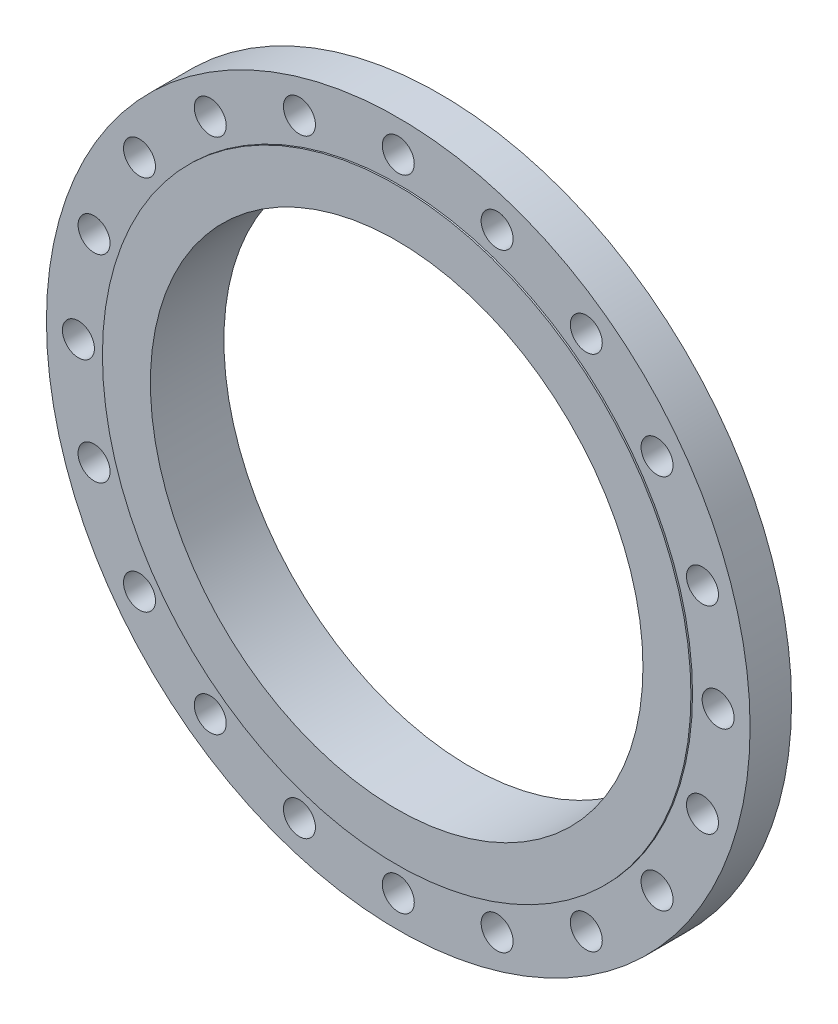
ISO-10303-21;
HEADER;
FILE_DESCRIPTION(('STEP AP214'),'2;1');
FILE_NAME('part.step','',(''),(''),'','','');
FILE_SCHEMA(('AUTOMOTIVE_DESIGN { 1 0 10303 214 1 1 1 1 }'));
ENDSEC;
DATA;
#1=APPLICATION_CONTEXT('core data for automotive mechanical design processes');
#2=APPLICATION_PROTOCOL_DEFINITION('international standard','automotive_design',2000,#1);
#3=PRODUCT_CONTEXT('',#1,'mechanical');
#4=PRODUCT('Part','Part','',(#3));
#5=PRODUCT_RELATED_PRODUCT_CATEGORY('part','',(#4));
#6=PRODUCT_DEFINITION_FORMATION('','',#4);
#7=PRODUCT_DEFINITION_CONTEXT('part definition',#1,'design');
#8=PRODUCT_DEFINITION('design','',#6,#7);
#9=PRODUCT_DEFINITION_SHAPE('','',#8);
#10=(LENGTH_UNIT() NAMED_UNIT(*) SI_UNIT(.MILLI.,.METRE.));
#11=(NAMED_UNIT(*) PLANE_ANGLE_UNIT() SI_UNIT($,.RADIAN.));
#12=(NAMED_UNIT(*) SI_UNIT($,.STERADIAN.) SOLID_ANGLE_UNIT());
#13=UNCERTAINTY_MEASURE_WITH_UNIT(LENGTH_MEASURE(1.E-05),#10,'distance_accuracy_value','');
#14=(GEOMETRIC_REPRESENTATION_CONTEXT(3) GLOBAL_UNCERTAINTY_ASSIGNED_CONTEXT((#13)) GLOBAL_UNIT_ASSIGNED_CONTEXT((#10,
#11,#12)) REPRESENTATION_CONTEXT('',''));
#15=CARTESIAN_POINT('',(0.,0.,0.));
#16=DIRECTION('',(0.,0.,1.));
#17=DIRECTION('',(1.,0.,0.));
#18=AXIS2_PLACEMENT_3D('',#15,#16,#17);
#19=CARTESIAN_POINT('',(0.,0.,31.07405273676));
#20=DIRECTION('',(0.,0.,-1.));
#21=DIRECTION('',(-1.,0.,0.));
#22=AXIS2_PLACEMENT_3D('',#19,#20,#21);
#23=CYLINDRICAL_SURFACE('',#22,292.1);
#24=CARTESIAN_POINT('',(0.,0.,29.48655273676));
#25=DIRECTION('',(0.,0.,1.));
#26=DIRECTION('',(1.,0.,0.));
#27=AXIS2_PLACEMENT_3D('',#24,#25,#26);
#28=CIRCLE('',#27,292.1);
#29=CARTESIAN_POINT('',(292.1,0.,29.48655273676));
#30=VERTEX_POINT('',#29);
#31=EDGE_CURVE('E48',#30,#30,#28,.T.);
#32=ORIENTED_EDGE('',*,*,#31,.T.);
#33=EDGE_LOOP('',(#32));
#34=FACE_BOUND('',#33,.T.);
#35=CARTESIAN_POINT('',(0.,0.,31.07405273676));
#36=DIRECTION('',(0.,0.,1.));
#37=DIRECTION('',(1.,0.,0.));
#38=AXIS2_PLACEMENT_3D('',#35,#36,#37);
#39=CIRCLE('',#38,292.1);
#40=CARTESIAN_POINT('',(292.1,0.,31.07405273676));
#41=VERTEX_POINT('',#40);
#42=EDGE_CURVE('E10',#41,#41,#39,.T.);
#43=ORIENTED_EDGE('',*,*,#42,.F.);
#44=EDGE_LOOP('',(#43));
#45=FACE_BOUND('',#44,.T.);
#46=ADVANCED_FACE('F37',(#34,#45),#23,.T.);
#47=CARTESIAN_POINT('',(0.,0.,31.07405273676));
#48=DIRECTION('',(0.,0.,1.));
#49=DIRECTION('',(1.,0.,0.));
#50=AXIS2_PLACEMENT_3D('',#47,#48,#49);
#51=PLANE('',#50);
#52=CARTESIAN_POINT('',(0.,0.,31.07405273676));
#53=DIRECTION('',(0.,0.,1.));
#54=DIRECTION('',(1.,0.,0.));
#55=AXIS2_PLACEMENT_3D('',#52,#53,#54);
#56=CIRCLE('',#55,244.475);
#57=CARTESIAN_POINT('',(244.475,0.,31.07405273676));
#58=VERTEX_POINT('',#57);
#59=EDGE_CURVE('E44',#58,#58,#56,.F.);
#60=ORIENTED_EDGE('',*,*,#59,.T.);
#61=EDGE_LOOP('',(#60));
#62=FACE_BOUND('',#61,.T.);
#63=ORIENTED_EDGE('',*,*,#42,.T.);
#64=EDGE_LOOP('',(#63));
#65=FACE_BOUND('',#64,.T.);
#66=ADVANCED_FACE('F204',(#62,#65),#51,.T.);
#67=CARTESIAN_POINT('',(0.,0.,81.87405273676));
#68=DIRECTION('',(0.,0.,-1.));
#69=DIRECTION('',(-1.,0.,0.));
#70=AXIS2_PLACEMENT_3D('',#67,#68,#69);
#71=CYLINDRICAL_SURFACE('',#70,244.475);
#72=ORIENTED_EDGE('',*,*,#59,.F.);
#73=EDGE_LOOP('',(#72));
#74=FACE_BOUND('',#73,.T.);
#75=CARTESIAN_POINT('',(0.,0.,-41.88744726324));
#76=DIRECTION('',(0.,0.,1.));
#77=DIRECTION('',(1.,0.,0.));
#78=AXIS2_PLACEMENT_3D('',#75,#76,#77);
#79=CIRCLE('',#78,244.475);
#80=CARTESIAN_POINT('',(244.475,0.,-41.88744726324));
#81=VERTEX_POINT('',#80);
#82=EDGE_CURVE('E40',#81,#81,#79,.T.);
#83=ORIENTED_EDGE('',*,*,#82,.F.);
#84=EDGE_LOOP('',(#83));
#85=FACE_BOUND('',#84,.T.);
#86=ADVANCED_FACE('F209',(#74,#85),#71,.F.);
#87=CARTESIAN_POINT('',(0.,0.,29.48655273676));
#88=DIRECTION('',(0.,0.,-1.));
#89=DIRECTION('',(-1.,0.,0.));
#90=AXIS2_PLACEMENT_3D('',#87,#88,#89);
#91=CYLINDRICAL_SURFACE('',#90,349.25);
#92=CARTESIAN_POINT('',(0.,0.,29.48655273676));
#93=DIRECTION('',(0.,0.,1.));
#94=DIRECTION('',(1.,0.,0.));
#95=AXIS2_PLACEMENT_3D('',#92,#93,#94);
#96=CIRCLE('',#95,349.25);
#97=CARTESIAN_POINT('',(349.25,0.,29.48655273676));
#98=VERTEX_POINT('',#97);
#99=EDGE_CURVE('E53',#98,#98,#96,.T.);
#100=ORIENTED_EDGE('',*,*,#99,.F.);
#101=EDGE_LOOP('',(#100));
#102=FACE_BOUND('',#101,.T.);
#103=CARTESIAN_POINT('',(0.,0.,-11.66144726324));
#104=DIRECTION('',(0.,0.,1.));
#105=DIRECTION('',(1.,0.,0.));
#106=AXIS2_PLACEMENT_3D('',#103,#104,#105);
#107=CIRCLE('',#106,349.25);
#108=CARTESIAN_POINT('',(349.25,0.,-11.66144726324));
#109=VERTEX_POINT('',#108);
#110=EDGE_CURVE('E54',#109,#109,#107,.T.);
#111=ORIENTED_EDGE('',*,*,#110,.T.);
#112=EDGE_LOOP('',(#111));
#113=FACE_BOUND('',#112,.T.);
#114=ADVANCED_FACE('F219',(#102,#113),#91,.T.);
#115=CARTESIAN_POINT('',(0.,0.,29.48655273676));
#116=DIRECTION('',(0.,0.,1.));
#117=DIRECTION('',(1.,0.,0.));
#118=AXIS2_PLACEMENT_3D('',#115,#116,#117);
#119=PLANE('',#118);
#120=CARTESIAN_POINT('',(186.621817602861,256.862895714046,29.4865527367601));
#121=DIRECTION('',(0.,0.,1.));
#122=DIRECTION('',(1.,0.,0.));
#123=AXIS2_PLACEMENT_3D('',#120,#121,#122);
#124=CIRCLE('',#123,15.875);
#125=CARTESIAN_POINT('',(202.496817602861,256.862895714046,29.4865527367601));
#126=VERTEX_POINT('',#125);
#127=EDGE_CURVE('E65',#126,#126,#124,.F.);
#128=ORIENTED_EDGE('',*,*,#127,.T.);
#129=EDGE_LOOP('',(#128));
#130=FACE_BOUND('',#129,.T.);
#131=CARTESIAN_POINT('',(256.862895714046,186.62181760286,29.4865527367601));
#132=DIRECTION('',(0.,0.,1.));
#133=DIRECTION('',(1.,0.,0.));
#134=AXIS2_PLACEMENT_3D('',#131,#132,#133);
#135=CIRCLE('',#134,15.875);
#136=CARTESIAN_POINT('',(272.737895714046,186.62181760286,29.4865527367601));
#137=VERTEX_POINT('',#136);
#138=EDGE_CURVE('E68',#137,#137,#135,.F.);
#139=ORIENTED_EDGE('',*,*,#138,.T.);
#140=EDGE_LOOP('',(#139));
#141=FACE_BOUND('',#140,.T.);
#142=CARTESIAN_POINT('',(301.960443923712,98.112895714045,29.4865527367601));
#143=DIRECTION('',(0.,0.,1.));
#144=DIRECTION('',(1.,0.,0.));
#145=AXIS2_PLACEMENT_3D('',#142,#143,#144);
#146=CIRCLE('',#145,15.875);
#147=CARTESIAN_POINT('',(317.835443923712,98.112895714045,29.4865527367601));
#148=VERTEX_POINT('',#147);
#149=EDGE_CURVE('E71',#148,#148,#146,.F.);
#150=ORIENTED_EDGE('',*,*,#149,.T.);
#151=EDGE_LOOP('',(#150));
#152=FACE_BOUND('',#151,.T.);
#153=CARTESIAN_POINT('',(317.5,-1.06346186208606E-12,29.4865527367601));
#154=DIRECTION('',(0.,0.,1.));
#155=DIRECTION('',(1.,0.,0.));
#156=AXIS2_PLACEMENT_3D('',#153,#154,#155);
#157=CIRCLE('',#156,15.875);
#158=CARTESIAN_POINT('',(333.375,-1.06346186208606E-12,29.4865527367601));
#159=VERTEX_POINT('',#158);
#160=EDGE_CURVE('E74',#159,#159,#157,.F.);
#161=ORIENTED_EDGE('',*,*,#160,.T.);
#162=EDGE_LOOP('',(#161));
#163=FACE_BOUND('',#162,.T.);
#164=CARTESIAN_POINT('',(301.960443923711,-98.1128957140471,29.4865527367601));
#165=DIRECTION('',(0.,0.,1.));
#166=DIRECTION('',(1.,0.,0.));
#167=AXIS2_PLACEMENT_3D('',#164,#165,#166);
#168=CIRCLE('',#167,15.875);
#169=CARTESIAN_POINT('',(317.835443923711,-98.1128957140471,29.4865527367601));
#170=VERTEX_POINT('',#169);
#171=EDGE_CURVE('E77',#170,#170,#168,.F.);
#172=ORIENTED_EDGE('',*,*,#171,.T.);
#173=EDGE_LOOP('',(#172));
#174=FACE_BOUND('',#173,.T.);
#175=CARTESIAN_POINT('',(256.862895714045,-186.621817602861,29.4865527367601));
#176=DIRECTION('',(0.,0.,1.));
#177=DIRECTION('',(1.,0.,0.));
#178=AXIS2_PLACEMENT_3D('',#175,#176,#177);
#179=CIRCLE('',#178,15.875);
#180=CARTESIAN_POINT('',(272.737895714045,-186.621817602861,29.4865527367601));
#181=VERTEX_POINT('',#180);
#182=EDGE_CURVE('E80',#181,#181,#179,.F.);
#183=ORIENTED_EDGE('',*,*,#182,.T.);
#184=EDGE_LOOP('',(#183));
#185=FACE_BOUND('',#184,.T.);
#186=CARTESIAN_POINT('',(186.621817602859,-256.862895714047,29.4865527367601));
#187=DIRECTION('',(0.,0.,1.));
#188=DIRECTION('',(1.,0.,0.));
#189=AXIS2_PLACEMENT_3D('',#186,#187,#188);
#190=CIRCLE('',#189,15.875);
#191=CARTESIAN_POINT('',(202.496817602859,-256.862895714047,29.4865527367601));
#192=VERTEX_POINT('',#191);
#193=EDGE_CURVE('E83',#192,#192,#190,.F.);
#194=ORIENTED_EDGE('',*,*,#193,.T.);
#195=EDGE_LOOP('',(#194));
#196=FACE_BOUND('',#195,.T.);
#197=CARTESIAN_POINT('',(98.1128957140438,-301.960443923712,29.4865527367601));
#198=DIRECTION('',(0.,0.,1.));
#199=DIRECTION('',(1.,0.,0.));
#200=AXIS2_PLACEMENT_3D('',#197,#198,#199);
#201=CIRCLE('',#200,15.875);
#202=CARTESIAN_POINT('',(113.987895714044,-301.960443923712,29.4865527367601));
#203=VERTEX_POINT('',#202);
#204=EDGE_CURVE('E86',#203,#203,#201,.F.);
#205=ORIENTED_EDGE('',*,*,#204,.T.);
#206=EDGE_LOOP('',(#205));
#207=FACE_BOUND('',#206,.T.);
#208=CARTESIAN_POINT('',(0.,-317.5,29.4865527367601));
#209=DIRECTION('',(0.,0.,1.));
#210=DIRECTION('',(1.,0.,0.));
#211=AXIS2_PLACEMENT_3D('',#208,#209,#210);
#212=CIRCLE('',#211,15.875);
#213=CARTESIAN_POINT('',(15.875,-317.5,29.4865527367601));
#214=VERTEX_POINT('',#213);
#215=EDGE_CURVE('E89',#214,#214,#212,.F.);
#216=ORIENTED_EDGE('',*,*,#215,.T.);
#217=EDGE_LOOP('',(#216));
#218=FACE_BOUND('',#217,.T.);
#219=CARTESIAN_POINT('',(-98.1128957140482,-301.96044392371,29.4865527367601));
#220=DIRECTION('',(0.,0.,1.));
#221=DIRECTION('',(1.,0.,0.));
#222=AXIS2_PLACEMENT_3D('',#219,#220,#221);
#223=CIRCLE('',#222,15.875);
#224=CARTESIAN_POINT('',(-82.2378957140482,-301.96044392371,29.4865527367601));
#225=VERTEX_POINT('',#224);
#226=EDGE_CURVE('E92',#225,#225,#223,.F.);
#227=ORIENTED_EDGE('',*,*,#226,.T.);
#228=EDGE_LOOP('',(#227));
#229=FACE_BOUND('',#228,.T.);
#230=CARTESIAN_POINT('',(-186.621817602862,-256.862895714044,29.4865527367601));
#231=DIRECTION('',(0.,0.,1.));
#232=DIRECTION('',(1.,0.,0.));
#233=AXIS2_PLACEMENT_3D('',#230,#231,#232);
#234=CIRCLE('',#233,15.875);
#235=CARTESIAN_POINT('',(-170.746817602862,-256.862895714044,29.4865527367601));
#236=VERTEX_POINT('',#235);
#237=EDGE_CURVE('E95',#236,#236,#234,.F.);
#238=ORIENTED_EDGE('',*,*,#237,.T.);
#239=EDGE_LOOP('',(#238));
#240=FACE_BOUND('',#239,.T.);
#241=CARTESIAN_POINT('',(-256.862895714048,-186.621817602858,29.4865527367601));
#242=DIRECTION('',(0.,0.,1.));
#243=DIRECTION('',(1.,0.,0.));
#244=AXIS2_PLACEMENT_3D('',#241,#242,#243);
#245=CIRCLE('',#244,15.875);
#246=CARTESIAN_POINT('',(-240.987895714048,-186.621817602858,29.4865527367601));
#247=VERTEX_POINT('',#246);
#248=EDGE_CURVE('E98',#247,#247,#245,.F.);
#249=ORIENTED_EDGE('',*,*,#248,.T.);
#250=EDGE_LOOP('',(#249));
#251=FACE_BOUND('',#250,.T.);
#252=CARTESIAN_POINT('',(-301.960443923712,-98.1128957140429,29.4865527367601));
#253=DIRECTION('',(0.,0.,1.));
#254=DIRECTION('',(1.,0.,0.));
#255=AXIS2_PLACEMENT_3D('',#252,#253,#254);
#256=CIRCLE('',#255,15.875);
#257=CARTESIAN_POINT('',(-286.085443923712,-98.1128957140429,29.4865527367601));
#258=VERTEX_POINT('',#257);
#259=EDGE_CURVE('E101',#258,#258,#256,.F.);
#260=ORIENTED_EDGE('',*,*,#259,.T.);
#261=EDGE_LOOP('',(#260));
#262=FACE_BOUND('',#261,.T.);
#263=CARTESIAN_POINT('',(-317.5,3.37071943824472E-12,29.4865527367601));
#264=DIRECTION('',(0.,0.,1.));
#265=DIRECTION('',(1.,0.,0.));
#266=AXIS2_PLACEMENT_3D('',#263,#264,#265);
#267=CIRCLE('',#266,15.875);
#268=CARTESIAN_POINT('',(-301.625,3.37071943824472E-12,29.4865527367601));
#269=VERTEX_POINT('',#268);
#270=EDGE_CURVE('E104',#269,#269,#267,.F.);
#271=ORIENTED_EDGE('',*,*,#270,.T.);
#272=EDGE_LOOP('',(#271));
#273=FACE_BOUND('',#272,.T.);
#274=CARTESIAN_POINT('',(-301.96044392371,98.1128957140493,29.4865527367601));
#275=DIRECTION('',(0.,0.,1.));
#276=DIRECTION('',(1.,0.,0.));
#277=AXIS2_PLACEMENT_3D('',#274,#275,#276);
#278=CIRCLE('',#277,15.875);
#279=CARTESIAN_POINT('',(-286.08544392371,98.1128957140493,29.4865527367601));
#280=VERTEX_POINT('',#279);
#281=EDGE_CURVE('E107',#280,#280,#278,.F.);
#282=ORIENTED_EDGE('',*,*,#281,.T.);
#283=EDGE_LOOP('',(#282));
#284=FACE_BOUND('',#283,.T.);
#285=CARTESIAN_POINT('',(-256.862895714044,186.621817602863,29.4865527367601));
#286=DIRECTION('',(0.,0.,1.));
#287=DIRECTION('',(1.,0.,0.));
#288=AXIS2_PLACEMENT_3D('',#285,#286,#287);
#289=CIRCLE('',#288,15.875);
#290=CARTESIAN_POINT('',(-240.987895714044,186.621817602863,29.4865527367601));
#291=VERTEX_POINT('',#290);
#292=EDGE_CURVE('E110',#291,#291,#289,.F.);
#293=ORIENTED_EDGE('',*,*,#292,.T.);
#294=EDGE_LOOP('',(#293));
#295=FACE_BOUND('',#294,.T.);
#296=CARTESIAN_POINT('',(-186.621817602857,256.862895714048,29.4865527367601));
#297=DIRECTION('',(0.,0.,1.));
#298=DIRECTION('',(1.,0.,0.));
#299=AXIS2_PLACEMENT_3D('',#296,#297,#298);
#300=CIRCLE('',#299,15.875);
#301=CARTESIAN_POINT('',(-170.746817602857,256.862895714048,29.4865527367601));
#302=VERTEX_POINT('',#301);
#303=EDGE_CURVE('E113',#302,#302,#300,.F.);
#304=ORIENTED_EDGE('',*,*,#303,.T.);
#305=EDGE_LOOP('',(#304));
#306=FACE_BOUND('',#305,.T.);
#307=CARTESIAN_POINT('',(-98.1128957140418,301.960443923713,29.4865527367601));
#308=DIRECTION('',(0.,0.,1.));
#309=DIRECTION('',(1.,0.,0.));
#310=AXIS2_PLACEMENT_3D('',#307,#308,#309);
#311=CIRCLE('',#310,15.875);
#312=CARTESIAN_POINT('',(-82.2378957140418,301.960443923713,29.4865527367601));
#313=VERTEX_POINT('',#312);
#314=EDGE_CURVE('E116',#313,#313,#311,.F.);
#315=ORIENTED_EDGE('',*,*,#314,.T.);
#316=EDGE_LOOP('',(#315));
#317=FACE_BOUND('',#316,.T.);
#318=CARTESIAN_POINT('',(98.1128957140461,301.960443923711,29.4865527367601));
#319=DIRECTION('',(0.,0.,1.));
#320=DIRECTION('',(1.,0.,0.));
#321=AXIS2_PLACEMENT_3D('',#318,#319,#320);
#322=CIRCLE('',#321,15.875);
#323=CARTESIAN_POINT('',(113.987895714046,301.960443923711,29.4865527367601));
#324=VERTEX_POINT('',#323);
#325=EDGE_CURVE('E119',#324,#324,#322,.F.);
#326=ORIENTED_EDGE('',*,*,#325,.T.);
#327=EDGE_LOOP('',(#326));
#328=FACE_BOUND('',#327,.T.);
#329=CARTESIAN_POINT('',(0.,317.5,29.4865527367601));
#330=DIRECTION('',(0.,0.,1.));
#331=DIRECTION('',(1.,0.,0.));
#332=AXIS2_PLACEMENT_3D('',#329,#330,#331);
#333=CIRCLE('',#332,15.875);
#334=CARTESIAN_POINT('',(15.875,317.5,29.4865527367601));
#335=VERTEX_POINT('',#334);
#336=EDGE_CURVE('E57',#335,#335,#333,.F.);
#337=ORIENTED_EDGE('',*,*,#336,.T.);
#338=EDGE_LOOP('',(#337));
#339=FACE_BOUND('',#338,.T.);
#340=ORIENTED_EDGE('',*,*,#31,.F.);
#341=EDGE_LOOP('',(#340));
#342=FACE_BOUND('',#341,.T.);
#343=ORIENTED_EDGE('',*,*,#99,.T.);
#344=EDGE_LOOP('',(#343));
#345=FACE_BOUND('',#344,.T.);
#346=ADVANCED_FACE('F215',(#130,#141,#152,#163,#174,#185,#196,#207,#218,#229,#240,#251,#262,
#273,#284,#295,#306,#317,#328,#339,#342,#345),#119,.T.);
#347=CARTESIAN_POINT('',(0.,0.,-11.66144726324));
#348=DIRECTION('',(0.,0.,1.));
#349=DIRECTION('',(1.,0.,0.));
#350=AXIS2_PLACEMENT_3D('',#347,#348,#349);
#351=PLANE('',#350);
#352=CARTESIAN_POINT('',(0.,0.,-11.66144726324));
#353=DIRECTION('',(0.,0.,1.));
#354=DIRECTION('',(1.,0.,0.));
#355=AXIS2_PLACEMENT_3D('',#352,#353,#354);
#356=CIRCLE('',#355,292.1);
#357=CARTESIAN_POINT('',(292.1,0.,-11.66144726324));
#358=VERTEX_POINT('',#357);
#359=EDGE_CURVE('E180',#358,#358,#356,.T.);
#360=ORIENTED_EDGE('',*,*,#359,.T.);
#361=EDGE_LOOP('',(#360));
#362=FACE_BOUND('',#361,.T.);
#363=CARTESIAN_POINT('',(186.621817602861,256.862895714046,-11.66144726324));
#364=DIRECTION('',(0.,0.,1.));
#365=DIRECTION('',(0.809016994374947,-0.587785252292474,0.));
#366=AXIS2_PLACEMENT_3D('',#363,#364,#365);
#367=CIRCLE('',#366,15.875);
#368=CARTESIAN_POINT('',(199.464962388563,247.531804833903,-11.66144726324));
#369=VERTEX_POINT('',#368);
#370=EDGE_CURVE('E125',#369,#369,#367,.T.);
#371=ORIENTED_EDGE('',*,*,#370,.T.);
#372=EDGE_LOOP('',(#371));
#373=FACE_BOUND('',#372,.T.);
#374=CARTESIAN_POINT('',(256.862895714046,186.62181760286,-11.66144726324));
#375=DIRECTION('',(0.,0.,1.));
#376=DIRECTION('',(0.587785252292471,-0.809016994374949,0.));
#377=AXIS2_PLACEMENT_3D('',#374,#375,#376);
#378=CIRCLE('',#377,15.875);
#379=CARTESIAN_POINT('',(266.193986594189,173.778672817157,-11.66144726324));
#380=VERTEX_POINT('',#379);
#381=EDGE_CURVE('E169',#380,#380,#378,.T.);
#382=ORIENTED_EDGE('',*,*,#381,.T.);
#383=EDGE_LOOP('',(#382));
#384=FACE_BOUND('',#383,.T.);
#385=CARTESIAN_POINT('',(301.960443923712,98.112895714045,-11.66144726324));
#386=DIRECTION('',(0.,0.,1.));
#387=DIRECTION('',(0.309016994374945,-0.951056516295155,0.));
#388=AXIS2_PLACEMENT_3D('',#385,#386,#387);
#389=CIRCLE('',#388,15.875);
#390=CARTESIAN_POINT('',(306.866088709414,83.0148735178594,-11.66144726324));
#391=VERTEX_POINT('',#390);
#392=EDGE_CURVE('E166',#391,#391,#389,.T.);
#393=ORIENTED_EDGE('',*,*,#392,.T.);
#394=EDGE_LOOP('',(#393));
#395=FACE_BOUND('',#394,.T.);
#396=CARTESIAN_POINT('',(317.5,-1.06346186208606E-12,-11.66144726324));
#397=DIRECTION('',(0.,0.,1.));
#398=DIRECTION('',(0.,-1.,0.));
#399=AXIS2_PLACEMENT_3D('',#396,#397,#398);
#400=CIRCLE('',#399,15.875);
#401=CARTESIAN_POINT('',(317.5,-15.8750000000011,-11.66144726324));
#402=VERTEX_POINT('',#401);
#403=EDGE_CURVE('E163',#402,#402,#400,.T.);
#404=ORIENTED_EDGE('',*,*,#403,.T.);
#405=EDGE_LOOP('',(#404));
#406=FACE_BOUND('',#405,.T.);
#407=CARTESIAN_POINT('',(301.960443923711,-98.1128957140471,-11.66144726324));
#408=DIRECTION('',(0.,0.,1.));
#409=DIRECTION('',(-0.309016994374952,-0.951056516295152,0.));
#410=AXIS2_PLACEMENT_3D('',#407,#408,#409);
#411=CIRCLE('',#410,15.875);
#412=CARTESIAN_POINT('',(297.054799138009,-113.210917910233,-11.66144726324));
#413=VERTEX_POINT('',#412);
#414=EDGE_CURVE('E160',#413,#413,#411,.T.);
#415=ORIENTED_EDGE('',*,*,#414,.T.);
#416=EDGE_LOOP('',(#415));
#417=FACE_BOUND('',#416,.T.);
#418=CARTESIAN_POINT('',(256.862895714045,-186.621817602861,-11.66144726324));
#419=DIRECTION('',(0.,0.,1.));
#420=DIRECTION('',(-0.587785252292477,-0.809016994374945,0.));
#421=AXIS2_PLACEMENT_3D('',#418,#419,#420);
#422=CIRCLE('',#421,15.875);
#423=CARTESIAN_POINT('',(247.531804833902,-199.464962388564,-11.66144726324));
#424=VERTEX_POINT('',#423);
#425=EDGE_CURVE('E157',#424,#424,#422,.T.);
#426=ORIENTED_EDGE('',*,*,#425,.T.);
#427=EDGE_LOOP('',(#426));
#428=FACE_BOUND('',#427,.T.);
#429=CARTESIAN_POINT('',(186.621817602859,-256.862895714047,-11.66144726324));
#430=DIRECTION('',(0.,0.,1.));
#431=DIRECTION('',(-0.809016994374951,-0.587785252292469,0.));
#432=AXIS2_PLACEMENT_3D('',#429,#430,#431);
#433=CIRCLE('',#432,15.875);
#434=CARTESIAN_POINT('',(173.778672817156,-266.19398659419,-11.66144726324));
#435=VERTEX_POINT('',#434);
#436=EDGE_CURVE('E154',#435,#435,#433,.T.);
#437=ORIENTED_EDGE('',*,*,#436,.T.);
#438=EDGE_LOOP('',(#437));
#439=FACE_BOUND('',#438,.T.);
#440=CARTESIAN_POINT('',(98.1128957140438,-301.960443923712,-11.66144726324));
#441=DIRECTION('',(0.,0.,1.));
#442=DIRECTION('',(-0.951056516295156,-0.309016994374941,0.));
#443=AXIS2_PLACEMENT_3D('',#440,#441,#442);
#444=CIRCLE('',#443,15.875);
#445=CARTESIAN_POINT('',(83.0148735178582,-306.866088709414,-11.66144726324));
#446=VERTEX_POINT('',#445);
#447=EDGE_CURVE('E151',#446,#446,#444,.T.);
#448=ORIENTED_EDGE('',*,*,#447,.T.);
#449=EDGE_LOOP('',(#448));
#450=FACE_BOUND('',#449,.T.);
#451=CARTESIAN_POINT('',(0.,-317.5,-11.66144726324));
#452=DIRECTION('',(0.,0.,1.));
#453=DIRECTION('',(-1.,0.,0.));
#454=AXIS2_PLACEMENT_3D('',#451,#452,#453);
#455=CIRCLE('',#454,15.875);
#456=CARTESIAN_POINT('',(-15.875,-317.5,-11.66144726324));
#457=VERTEX_POINT('',#456);
#458=EDGE_CURVE('E148',#457,#457,#455,.T.);
#459=ORIENTED_EDGE('',*,*,#458,.T.);
#460=EDGE_LOOP('',(#459));
#461=FACE_BOUND('',#460,.T.);
#462=CARTESIAN_POINT('',(-98.1128957140482,-301.96044392371,-11.66144726324));
#463=DIRECTION('',(0.,0.,1.));
#464=DIRECTION('',(-0.951056516295151,0.309016994374955,0.));
#465=AXIS2_PLACEMENT_3D('',#462,#463,#464);
#466=CIRCLE('',#465,15.875);
#467=CARTESIAN_POINT('',(-113.210917910234,-297.054799138008,-11.66144726324));
#468=VERTEX_POINT('',#467);
#469=EDGE_CURVE('E145',#468,#468,#466,.T.);
#470=ORIENTED_EDGE('',*,*,#469,.T.);
#471=EDGE_LOOP('',(#470));
#472=FACE_BOUND('',#471,.T.);
#473=CARTESIAN_POINT('',(-186.621817602862,-256.862895714044,-11.66144726324));
#474=DIRECTION('',(0.,0.,1.));
#475=DIRECTION('',(-0.809016994374942,0.58778525229248,0.));
#476=AXIS2_PLACEMENT_3D('',#473,#474,#475);
#477=CIRCLE('',#476,15.875);
#478=CARTESIAN_POINT('',(-199.464962388565,-247.531804833901,-11.66144726324));
#479=VERTEX_POINT('',#478);
#480=EDGE_CURVE('E142',#479,#479,#477,.T.);
#481=ORIENTED_EDGE('',*,*,#480,.T.);
#482=EDGE_LOOP('',(#481));
#483=FACE_BOUND('',#482,.T.);
#484=CARTESIAN_POINT('',(-256.862895714048,-186.621817602858,-11.66144726324));
#485=DIRECTION('',(0.,0.,1.));
#486=DIRECTION('',(-0.587785252292465,0.809016994374953,0.));
#487=AXIS2_PLACEMENT_3D('',#484,#485,#486);
#488=CIRCLE('',#487,15.875);
#489=CARTESIAN_POINT('',(-266.19398659419,-173.778672817155,-11.66144726324));
#490=VERTEX_POINT('',#489);
#491=EDGE_CURVE('E139',#490,#490,#488,.T.);
#492=ORIENTED_EDGE('',*,*,#491,.T.);
#493=EDGE_LOOP('',(#492));
#494=FACE_BOUND('',#493,.T.);
#495=CARTESIAN_POINT('',(-301.960443923712,-98.1128957140429,-11.66144726324));
#496=DIRECTION('',(0.,0.,1.));
#497=DIRECTION('',(-0.309016994374938,0.951056516295157,0.));
#498=AXIS2_PLACEMENT_3D('',#495,#496,#497);
#499=CIRCLE('',#498,15.875);
#500=CARTESIAN_POINT('',(-306.866088709414,-83.0148735178572,-11.66144726324));
#501=VERTEX_POINT('',#500);
#502=EDGE_CURVE('E136',#501,#501,#499,.T.);
#503=ORIENTED_EDGE('',*,*,#502,.T.);
#504=EDGE_LOOP('',(#503));
#505=FACE_BOUND('',#504,.T.);
#506=CARTESIAN_POINT('',(-317.5,3.37071943824472E-12,-11.66144726324));
#507=DIRECTION('',(0.,0.,1.));
#508=DIRECTION('',(0.,1.,0.));
#509=AXIS2_PLACEMENT_3D('',#506,#507,#508);
#510=CIRCLE('',#509,15.875);
#511=CARTESIAN_POINT('',(-317.5,15.8750000000034,-11.66144726324));
#512=VERTEX_POINT('',#511);
#513=EDGE_CURVE('E133',#512,#512,#510,.T.);
#514=ORIENTED_EDGE('',*,*,#513,.T.);
#515=EDGE_LOOP('',(#514));
#516=FACE_BOUND('',#515,.T.);
#517=CARTESIAN_POINT('',(-301.96044392371,98.1128957140493,-11.66144726324));
#518=DIRECTION('',(0.,0.,1.));
#519=DIRECTION('',(0.309016994374958,0.95105651629515,0.));
#520=AXIS2_PLACEMENT_3D('',#517,#518,#519);
#521=CIRCLE('',#520,15.875);
#522=CARTESIAN_POINT('',(-297.054799138008,113.210917910235,-11.66144726324));
#523=VERTEX_POINT('',#522);
#524=EDGE_CURVE('E129',#523,#523,#521,.T.);
#525=ORIENTED_EDGE('',*,*,#524,.T.);
#526=EDGE_LOOP('',(#525));
#527=FACE_BOUND('',#526,.T.);
#528=CARTESIAN_POINT('',(-256.862895714044,186.621817602863,-11.66144726324));
#529=DIRECTION('',(0.,0.,1.));
#530=DIRECTION('',(0.587785252292483,0.80901699437494,0.));
#531=AXIS2_PLACEMENT_3D('',#528,#529,#530);
#532=CIRCLE('',#531,15.875);
#533=CARTESIAN_POINT('',(-247.5318048339,199.464962388566,-11.66144726324));
#534=VERTEX_POINT('',#533);
#535=EDGE_CURVE('E126',#534,#534,#532,.T.);
#536=ORIENTED_EDGE('',*,*,#535,.T.);
#537=EDGE_LOOP('',(#536));
#538=FACE_BOUND('',#537,.T.);
#539=CARTESIAN_POINT('',(-186.621817602857,256.862895714048,-11.66144726324));
#540=DIRECTION('',(0.,0.,1.));
#541=DIRECTION('',(0.809016994374955,0.587785252292462,0.));
#542=AXIS2_PLACEMENT_3D('',#539,#540,#541);
#543=CIRCLE('',#542,15.875);
#544=CARTESIAN_POINT('',(-173.778672817154,266.193986594191,-11.66144726324));
#545=VERTEX_POINT('',#544);
#546=EDGE_CURVE('E130',#545,#545,#543,.T.);
#547=ORIENTED_EDGE('',*,*,#546,.T.);
#548=EDGE_LOOP('',(#547));
#549=FACE_BOUND('',#548,.T.);
#550=CARTESIAN_POINT('',(-98.1128957140418,301.960443923713,-11.66144726324));
#551=DIRECTION('',(0.,0.,1.));
#552=DIRECTION('',(0.951056516295158,0.309016994374935,0.));
#553=AXIS2_PLACEMENT_3D('',#550,#551,#552);
#554=CIRCLE('',#553,15.875);
#555=CARTESIAN_POINT('',(-83.0148735178562,306.866088709415,-11.66144726324));
#556=VERTEX_POINT('',#555);
#557=EDGE_CURVE('E174',#556,#556,#554,.T.);
#558=ORIENTED_EDGE('',*,*,#557,.T.);
#559=EDGE_LOOP('',(#558));
#560=FACE_BOUND('',#559,.T.);
#561=CARTESIAN_POINT('',(98.1128957140461,301.960443923711,-11.66144726324));
#562=DIRECTION('',(0.,0.,1.));
#563=DIRECTION('',(0.951056516295154,-0.309016994374948,0.));
#564=AXIS2_PLACEMENT_3D('',#561,#562,#563);
#565=CIRCLE('',#564,15.875);
#566=CARTESIAN_POINT('',(113.210917910232,297.054799138009,-11.66144726324));
#567=VERTEX_POINT('',#566);
#568=EDGE_CURVE('E122',#567,#567,#565,.T.);
#569=ORIENTED_EDGE('',*,*,#568,.T.);
#570=EDGE_LOOP('',(#569));
#571=FACE_BOUND('',#570,.T.);
#572=CARTESIAN_POINT('',(0.,317.5,-11.66144726324));
#573=DIRECTION('',(0.,0.,1.));
#574=DIRECTION('',(1.,0.,0.));
#575=AXIS2_PLACEMENT_3D('',#572,#573,#574);
#576=CIRCLE('',#575,15.875);
#577=CARTESIAN_POINT('',(15.875,317.5,-11.66144726324));
#578=VERTEX_POINT('',#577);
#579=EDGE_CURVE('E62',#578,#578,#576,.T.);
#580=ORIENTED_EDGE('',*,*,#579,.T.);
#581=EDGE_LOOP('',(#580));
#582=FACE_BOUND('',#581,.T.);
#583=ORIENTED_EDGE('',*,*,#110,.F.);
#584=EDGE_LOOP('',(#583));
#585=FACE_BOUND('',#584,.T.);
#586=ADVANCED_FACE('F218',(#362,#373,#384,#395,#406,#417,#428,#439,#450,#461,#472,#483,#494,
#505,#516,#527,#538,#549,#560,#571,#582,#585),#351,.F.);
#587=CARTESIAN_POINT('',(0.,317.5,1477.28655273676));
#588=DIRECTION('',(0.,0.,-1.));
#589=DIRECTION('',(-1.,0.,0.));
#590=AXIS2_PLACEMENT_3D('',#587,#588,#589);
#591=CYLINDRICAL_SURFACE('',#590,15.875);
#592=ORIENTED_EDGE('',*,*,#336,.F.);
#593=EDGE_LOOP('',(#592));
#594=FACE_BOUND('',#593,.T.);
#595=ORIENTED_EDGE('',*,*,#579,.F.);
#596=EDGE_LOOP('',(#595));
#597=FACE_BOUND('',#596,.T.);
#598=ADVANCED_FACE('F230',(#594,#597),#591,.F.);
#599=CARTESIAN_POINT('',(98.1128957140461,301.960443923711,1477.28655273676));
#600=DIRECTION('',(0.,0.,-1.));
#601=DIRECTION('',(-1.,0.,0.));
#602=AXIS2_PLACEMENT_3D('',#599,#600,#601);
#603=CYLINDRICAL_SURFACE('',#602,15.875);
#604=ORIENTED_EDGE('',*,*,#325,.F.);
#605=EDGE_LOOP('',(#604));
#606=FACE_BOUND('',#605,.T.);
#607=ORIENTED_EDGE('',*,*,#568,.F.);
#608=EDGE_LOOP('',(#607));
#609=FACE_BOUND('',#608,.T.);
#610=ADVANCED_FACE('F235',(#606,#609),#603,.F.);
#611=CARTESIAN_POINT('',(-98.1128957140418,301.960443923713,1477.28655273676));
#612=DIRECTION('',(0.,0.,-1.));
#613=DIRECTION('',(-1.,0.,0.));
#614=AXIS2_PLACEMENT_3D('',#611,#612,#613);
#615=CYLINDRICAL_SURFACE('',#614,15.875);
#616=ORIENTED_EDGE('',*,*,#314,.F.);
#617=EDGE_LOOP('',(#616));
#618=FACE_BOUND('',#617,.T.);
#619=ORIENTED_EDGE('',*,*,#557,.F.);
#620=EDGE_LOOP('',(#619));
#621=FACE_BOUND('',#620,.T.);
#622=ADVANCED_FACE('F245',(#618,#621),#615,.F.);
#623=CARTESIAN_POINT('',(-186.621817602857,256.862895714048,1477.28655273676));
#624=DIRECTION('',(0.,0.,-1.));
#625=DIRECTION('',(-1.,0.,0.));
#626=AXIS2_PLACEMENT_3D('',#623,#624,#625);
#627=CYLINDRICAL_SURFACE('',#626,15.875);
#628=ORIENTED_EDGE('',*,*,#303,.F.);
#629=EDGE_LOOP('',(#628));
#630=FACE_BOUND('',#629,.T.);
#631=ORIENTED_EDGE('',*,*,#546,.F.);
#632=EDGE_LOOP('',(#631));
#633=FACE_BOUND('',#632,.T.);
#634=ADVANCED_FACE('F251',(#630,#633),#627,.F.);
#635=CARTESIAN_POINT('',(-256.862895714044,186.621817602863,1477.28655273676));
#636=DIRECTION('',(0.,0.,-1.));
#637=DIRECTION('',(-1.,0.,0.));
#638=AXIS2_PLACEMENT_3D('',#635,#636,#637);
#639=CYLINDRICAL_SURFACE('',#638,15.875);
#640=ORIENTED_EDGE('',*,*,#292,.F.);
#641=EDGE_LOOP('',(#640));
#642=FACE_BOUND('',#641,.T.);
#643=ORIENTED_EDGE('',*,*,#535,.F.);
#644=EDGE_LOOP('',(#643));
#645=FACE_BOUND('',#644,.T.);
#646=ADVANCED_FACE('F247',(#642,#645),#639,.F.);
#647=CARTESIAN_POINT('',(-301.96044392371,98.1128957140493,1477.28655273676));
#648=DIRECTION('',(0.,0.,-1.));
#649=DIRECTION('',(-1.,0.,0.));
#650=AXIS2_PLACEMENT_3D('',#647,#648,#649);
#651=CYLINDRICAL_SURFACE('',#650,15.875);
#652=ORIENTED_EDGE('',*,*,#281,.F.);
#653=EDGE_LOOP('',(#652));
#654=FACE_BOUND('',#653,.T.);
#655=ORIENTED_EDGE('',*,*,#524,.F.);
#656=EDGE_LOOP('',(#655));
#657=FACE_BOUND('',#656,.T.);
#658=ADVANCED_FACE('F250',(#654,#657),#651,.F.);
#659=CARTESIAN_POINT('',(-317.5,3.37071943824472E-12,1477.28655273676));
#660=DIRECTION('',(0.,0.,-1.));
#661=DIRECTION('',(-1.,0.,0.));
#662=AXIS2_PLACEMENT_3D('',#659,#660,#661);
#663=CYLINDRICAL_SURFACE('',#662,15.875);
#664=ORIENTED_EDGE('',*,*,#270,.F.);
#665=EDGE_LOOP('',(#664));
#666=FACE_BOUND('',#665,.T.);
#667=ORIENTED_EDGE('',*,*,#513,.F.);
#668=EDGE_LOOP('',(#667));
#669=FACE_BOUND('',#668,.T.);
#670=ADVANCED_FACE('F255',(#666,#669),#663,.F.);
#671=CARTESIAN_POINT('',(-301.960443923712,-98.1128957140429,1477.28655273676));
#672=DIRECTION('',(0.,0.,-1.));
#673=DIRECTION('',(-1.,0.,0.));
#674=AXIS2_PLACEMENT_3D('',#671,#672,#673);
#675=CYLINDRICAL_SURFACE('',#674,15.875);
#676=ORIENTED_EDGE('',*,*,#259,.F.);
#677=EDGE_LOOP('',(#676));
#678=FACE_BOUND('',#677,.T.);
#679=ORIENTED_EDGE('',*,*,#502,.F.);
#680=EDGE_LOOP('',(#679));
#681=FACE_BOUND('',#680,.T.);
#682=ADVANCED_FACE('F259',(#678,#681),#675,.F.);
#683=CARTESIAN_POINT('',(-256.862895714048,-186.621817602858,1477.28655273676));
#684=DIRECTION('',(0.,0.,-1.));
#685=DIRECTION('',(-1.,0.,0.));
#686=AXIS2_PLACEMENT_3D('',#683,#684,#685);
#687=CYLINDRICAL_SURFACE('',#686,15.875);
#688=ORIENTED_EDGE('',*,*,#248,.F.);
#689=EDGE_LOOP('',(#688));
#690=FACE_BOUND('',#689,.T.);
#691=ORIENTED_EDGE('',*,*,#491,.F.);
#692=EDGE_LOOP('',(#691));
#693=FACE_BOUND('',#692,.T.);
#694=ADVANCED_FACE('F263',(#690,#693),#687,.F.);
#695=CARTESIAN_POINT('',(-186.621817602862,-256.862895714044,1477.28655273676));
#696=DIRECTION('',(0.,0.,-1.));
#697=DIRECTION('',(-1.,0.,0.));
#698=AXIS2_PLACEMENT_3D('',#695,#696,#697);
#699=CYLINDRICAL_SURFACE('',#698,15.875);
#700=ORIENTED_EDGE('',*,*,#237,.F.);
#701=EDGE_LOOP('',(#700));
#702=FACE_BOUND('',#701,.T.);
#703=ORIENTED_EDGE('',*,*,#480,.F.);
#704=EDGE_LOOP('',(#703));
#705=FACE_BOUND('',#704,.T.);
#706=ADVANCED_FACE('F267',(#702,#705),#699,.F.);
#707=CARTESIAN_POINT('',(-98.1128957140482,-301.96044392371,1477.28655273676));
#708=DIRECTION('',(0.,0.,-1.));
#709=DIRECTION('',(-1.,0.,0.));
#710=AXIS2_PLACEMENT_3D('',#707,#708,#709);
#711=CYLINDRICAL_SURFACE('',#710,15.875);
#712=ORIENTED_EDGE('',*,*,#226,.F.);
#713=EDGE_LOOP('',(#712));
#714=FACE_BOUND('',#713,.T.);
#715=ORIENTED_EDGE('',*,*,#469,.F.);
#716=EDGE_LOOP('',(#715));
#717=FACE_BOUND('',#716,.T.);
#718=ADVANCED_FACE('F271',(#714,#717),#711,.F.);
#719=CARTESIAN_POINT('',(0.,-317.5,1477.28655273676));
#720=DIRECTION('',(0.,0.,-1.));
#721=DIRECTION('',(-1.,0.,0.));
#722=AXIS2_PLACEMENT_3D('',#719,#720,#721);
#723=CYLINDRICAL_SURFACE('',#722,15.875);
#724=ORIENTED_EDGE('',*,*,#215,.F.);
#725=EDGE_LOOP('',(#724));
#726=FACE_BOUND('',#725,.T.);
#727=ORIENTED_EDGE('',*,*,#458,.F.);
#728=EDGE_LOOP('',(#727));
#729=FACE_BOUND('',#728,.T.);
#730=ADVANCED_FACE('F275',(#726,#729),#723,.F.);
#731=CARTESIAN_POINT('',(98.1128957140438,-301.960443923712,1477.28655273676));
#732=DIRECTION('',(0.,0.,-1.));
#733=DIRECTION('',(-1.,0.,0.));
#734=AXIS2_PLACEMENT_3D('',#731,#732,#733);
#735=CYLINDRICAL_SURFACE('',#734,15.875);
#736=ORIENTED_EDGE('',*,*,#204,.F.);
#737=EDGE_LOOP('',(#736));
#738=FACE_BOUND('',#737,.T.);
#739=ORIENTED_EDGE('',*,*,#447,.F.);
#740=EDGE_LOOP('',(#739));
#741=FACE_BOUND('',#740,.T.);
#742=ADVANCED_FACE('F279',(#738,#741),#735,.F.);
#743=CARTESIAN_POINT('',(186.621817602859,-256.862895714047,1477.28655273676));
#744=DIRECTION('',(0.,0.,-1.));
#745=DIRECTION('',(-1.,0.,0.));
#746=AXIS2_PLACEMENT_3D('',#743,#744,#745);
#747=CYLINDRICAL_SURFACE('',#746,15.875);
#748=ORIENTED_EDGE('',*,*,#193,.F.);
#749=EDGE_LOOP('',(#748));
#750=FACE_BOUND('',#749,.T.);
#751=ORIENTED_EDGE('',*,*,#436,.F.);
#752=EDGE_LOOP('',(#751));
#753=FACE_BOUND('',#752,.T.);
#754=ADVANCED_FACE('F283',(#750,#753),#747,.F.);
#755=CARTESIAN_POINT('',(256.862895714045,-186.621817602861,1477.28655273676));
#756=DIRECTION('',(0.,0.,-1.));
#757=DIRECTION('',(-1.,0.,0.));
#758=AXIS2_PLACEMENT_3D('',#755,#756,#757);
#759=CYLINDRICAL_SURFACE('',#758,15.875);
#760=ORIENTED_EDGE('',*,*,#182,.F.);
#761=EDGE_LOOP('',(#760));
#762=FACE_BOUND('',#761,.T.);
#763=ORIENTED_EDGE('',*,*,#425,.F.);
#764=EDGE_LOOP('',(#763));
#765=FACE_BOUND('',#764,.T.);
#766=ADVANCED_FACE('F287',(#762,#765),#759,.F.);
#767=CARTESIAN_POINT('',(301.960443923711,-98.1128957140471,1477.28655273676));
#768=DIRECTION('',(0.,0.,-1.));
#769=DIRECTION('',(-1.,0.,0.));
#770=AXIS2_PLACEMENT_3D('',#767,#768,#769);
#771=CYLINDRICAL_SURFACE('',#770,15.875);
#772=ORIENTED_EDGE('',*,*,#171,.F.);
#773=EDGE_LOOP('',(#772));
#774=FACE_BOUND('',#773,.T.);
#775=ORIENTED_EDGE('',*,*,#414,.F.);
#776=EDGE_LOOP('',(#775));
#777=FACE_BOUND('',#776,.T.);
#778=ADVANCED_FACE('F291',(#774,#777),#771,.F.);
#779=CARTESIAN_POINT('',(317.5,-1.06346186208606E-12,1477.28655273676));
#780=DIRECTION('',(0.,0.,-1.));
#781=DIRECTION('',(-1.,0.,0.));
#782=AXIS2_PLACEMENT_3D('',#779,#780,#781);
#783=CYLINDRICAL_SURFACE('',#782,15.875);
#784=ORIENTED_EDGE('',*,*,#160,.F.);
#785=EDGE_LOOP('',(#784));
#786=FACE_BOUND('',#785,.T.);
#787=ORIENTED_EDGE('',*,*,#403,.F.);
#788=EDGE_LOOP('',(#787));
#789=FACE_BOUND('',#788,.T.);
#790=ADVANCED_FACE('F295',(#786,#789),#783,.F.);
#791=CARTESIAN_POINT('',(301.960443923712,98.112895714045,1477.28655273676));
#792=DIRECTION('',(0.,0.,-1.));
#793=DIRECTION('',(-1.,0.,0.));
#794=AXIS2_PLACEMENT_3D('',#791,#792,#793);
#795=CYLINDRICAL_SURFACE('',#794,15.875);
#796=ORIENTED_EDGE('',*,*,#149,.F.);
#797=EDGE_LOOP('',(#796));
#798=FACE_BOUND('',#797,.T.);
#799=ORIENTED_EDGE('',*,*,#392,.F.);
#800=EDGE_LOOP('',(#799));
#801=FACE_BOUND('',#800,.T.);
#802=ADVANCED_FACE('F299',(#798,#801),#795,.F.);
#803=CARTESIAN_POINT('',(256.862895714046,186.62181760286,1477.28655273676));
#804=DIRECTION('',(0.,0.,-1.));
#805=DIRECTION('',(-1.,0.,0.));
#806=AXIS2_PLACEMENT_3D('',#803,#804,#805);
#807=CYLINDRICAL_SURFACE('',#806,15.875);
#808=ORIENTED_EDGE('',*,*,#138,.F.);
#809=EDGE_LOOP('',(#808));
#810=FACE_BOUND('',#809,.T.);
#811=ORIENTED_EDGE('',*,*,#381,.F.);
#812=EDGE_LOOP('',(#811));
#813=FACE_BOUND('',#812,.T.);
#814=ADVANCED_FACE('F199',(#810,#813),#807,.F.);
#815=CARTESIAN_POINT('',(186.621817602861,256.862895714046,1477.28655273676));
#816=DIRECTION('',(0.,0.,-1.));
#817=DIRECTION('',(-1.,0.,0.));
#818=AXIS2_PLACEMENT_3D('',#815,#816,#817);
#819=CYLINDRICAL_SURFACE('',#818,15.875);
#820=ORIENTED_EDGE('',*,*,#127,.F.);
#821=EDGE_LOOP('',(#820));
#822=FACE_BOUND('',#821,.T.);
#823=ORIENTED_EDGE('',*,*,#370,.F.);
#824=EDGE_LOOP('',(#823));
#825=FACE_BOUND('',#824,.T.);
#826=ADVANCED_FACE('F191',(#822,#825),#819,.F.);
#827=CARTESIAN_POINT('',(0.,0.,-41.88744726324));
#828=DIRECTION('',(0.,0.,1.));
#829=DIRECTION('',(1.,0.,0.));
#830=AXIS2_PLACEMENT_3D('',#827,#828,#829);
#831=PLANE('',#830);
#832=ORIENTED_EDGE('',*,*,#82,.T.);
#833=EDGE_LOOP('',(#832));
#834=FACE_BOUND('',#833,.T.);
#835=CARTESIAN_POINT('',(0.,0.,-41.88744726324));
#836=DIRECTION('',(0.,0.,1.));
#837=DIRECTION('',(1.,0.,0.));
#838=AXIS2_PLACEMENT_3D('',#835,#836,#837);
#839=CIRCLE('',#838,292.1);
#840=CARTESIAN_POINT('',(292.1,0.,-41.88744726324));
#841=VERTEX_POINT('',#840);
#842=EDGE_CURVE('E177',#841,#841,#839,.T.);
#843=ORIENTED_EDGE('',*,*,#842,.F.);
#844=EDGE_LOOP('',(#843));
#845=FACE_BOUND('',#844,.T.);
#846=ADVANCED_FACE('F189',(#834,#845),#831,.F.);
#847=CARTESIAN_POINT('',(0.,0.,-41.88744726324));
#848=DIRECTION('',(0.,0.,1.));
#849=DIRECTION('',(1.,0.,0.));
#850=AXIS2_PLACEMENT_3D('',#847,#848,#849);
#851=CYLINDRICAL_SURFACE('',#850,292.1);
#852=ORIENTED_EDGE('',*,*,#842,.T.);
#853=EDGE_LOOP('',(#852));
#854=FACE_BOUND('',#853,.T.);
#855=ORIENTED_EDGE('',*,*,#359,.F.);
#856=EDGE_LOOP('',(#855));
#857=FACE_BOUND('',#856,.T.);
#858=ADVANCED_FACE('F186',(#854,#857),#851,.T.);
#859=CLOSED_SHELL('',(#46,#66,#86,#114,#346,#586,#598,#610,#622,#634,#646,#658,#670,#682,#694,
#706,#718,#730,#742,#754,#766,#778,#790,#802,#814,#826,#846,#858));
#860=MANIFOLD_SOLID_BREP('B2',#859);
#861=ADVANCED_BREP_SHAPE_REPRESENTATION('',(#18,#860),#14);
#862=SHAPE_DEFINITION_REPRESENTATION(#9,#861);
ENDSEC;
END-ISO-10303-21;
